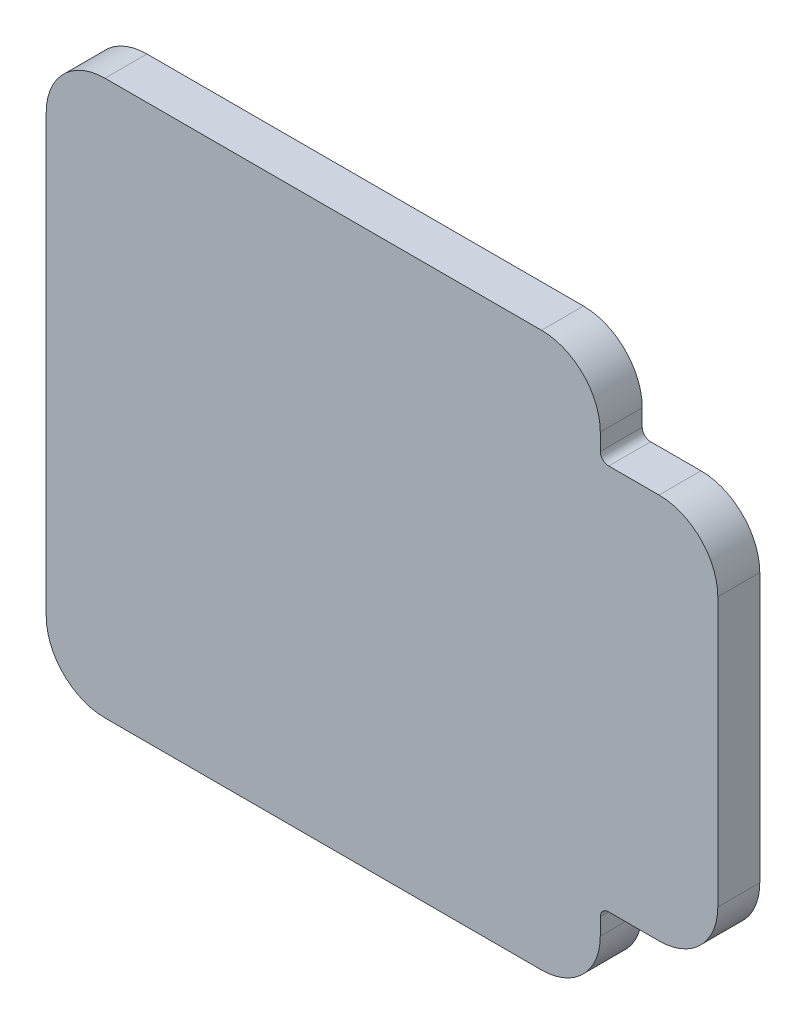
ISO-10303-21;
HEADER;
FILE_DESCRIPTION(('STEP AP214'),'2;1');
FILE_NAME('part.step','',(''),(''),'','','');
FILE_SCHEMA(('AUTOMOTIVE_DESIGN { 1 0 10303 214 1 1 1 1 }'));
ENDSEC;
DATA;
#1=APPLICATION_CONTEXT('core data for automotive mechanical design processes');
#2=APPLICATION_PROTOCOL_DEFINITION('international standard','automotive_design',2000,#1);
#3=PRODUCT_CONTEXT('',#1,'mechanical');
#4=PRODUCT('Part','Part','',(#3));
#5=PRODUCT_RELATED_PRODUCT_CATEGORY('part','',(#4));
#6=PRODUCT_DEFINITION_FORMATION('','',#4);
#7=PRODUCT_DEFINITION_CONTEXT('part definition',#1,'design');
#8=PRODUCT_DEFINITION('design','',#6,#7);
#9=PRODUCT_DEFINITION_SHAPE('','',#8);
#10=(LENGTH_UNIT() NAMED_UNIT(*) SI_UNIT(.MILLI.,.METRE.));
#11=(NAMED_UNIT(*) PLANE_ANGLE_UNIT() SI_UNIT($,.RADIAN.));
#12=(NAMED_UNIT(*) SI_UNIT($,.STERADIAN.) SOLID_ANGLE_UNIT());
#13=UNCERTAINTY_MEASURE_WITH_UNIT(LENGTH_MEASURE(1.E-05),#10,'distance_accuracy_value','');
#14=(GEOMETRIC_REPRESENTATION_CONTEXT(3) GLOBAL_UNCERTAINTY_ASSIGNED_CONTEXT((#13)) GLOBAL_UNIT_ASSIGNED_CONTEXT((#10,
#11,#12)) REPRESENTATION_CONTEXT('',''));
#15=CARTESIAN_POINT('',(0.,0.,0.));
#16=DIRECTION('',(0.,0.,1.));
#17=DIRECTION('',(1.,0.,0.));
#18=AXIS2_PLACEMENT_3D('',#15,#16,#17);
#19=CARTESIAN_POINT('',(-6.7960756515444,-23.1450892857143,2.5));
#20=DIRECTION('',(0.,0.,-1.));
#21=DIRECTION('',(-1.,0.,0.));
#22=AXIS2_PLACEMENT_3D('',#19,#20,#21);
#23=CYLINDRICAL_SURFACE('',#22,3.5);
#24=CARTESIAN_POINT('',(-6.7960756515444,-23.1450892857143,0.));
#25=DIRECTION('',(0.,0.,-1.));
#26=DIRECTION('',(-1.,0.,0.));
#27=AXIS2_PLACEMENT_3D('',#24,#25,#26);
#28=CIRCLE('',#27,3.5);
#29=CARTESIAN_POINT('',(-6.79607565154438,-26.6450892857143,0.));
#30=VERTEX_POINT('',#29);
#31=CARTESIAN_POINT('',(-10.2960756515444,-23.1450892857143,0.));
#32=VERTEX_POINT('',#31);
#33=EDGE_CURVE('E178',#30,#32,#28,.T.);
#34=ORIENTED_EDGE('',*,*,#33,.F.);
#35=DIRECTION('',(0.,0.,-1.));
#36=VECTOR('',#35,1.);
#37=CARTESIAN_POINT('',(-6.79607565154438,-26.6450892857143,2.5));
#38=LINE('',#37,#36);
#39=CARTESIAN_POINT('',(-6.79607565154438,-26.6450892857143,2.5));
#40=VERTEX_POINT('',#39);
#41=EDGE_CURVE('E11',#40,#30,#38,.T.);
#42=ORIENTED_EDGE('',*,*,#41,.F.);
#43=CARTESIAN_POINT('',(-6.7960756515444,-23.1450892857143,2.5));
#44=DIRECTION('',(0.,0.,-1.));
#45=DIRECTION('',(-1.,0.,0.));
#46=AXIS2_PLACEMENT_3D('',#43,#44,#45);
#47=CIRCLE('',#46,3.5);
#48=CARTESIAN_POINT('',(-10.2960756515444,-23.1450892857143,2.5));
#49=VERTEX_POINT('',#48);
#50=EDGE_CURVE('E222',#40,#49,#47,.T.);
#51=ORIENTED_EDGE('',*,*,#50,.T.);
#52=DIRECTION('',(0.,0.,-1.));
#53=VECTOR('',#52,1.);
#54=CARTESIAN_POINT('',(-10.2960756515444,-23.1450892857143,2.5));
#55=LINE('',#54,#53);
#56=EDGE_CURVE('E36',#49,#32,#55,.T.);
#57=ORIENTED_EDGE('',*,*,#56,.T.);
#58=EDGE_LOOP('',(#34,#42,#51,#57));
#59=FACE_BOUND('',#58,.T.);
#60=ADVANCED_FACE('F33',(#59),#23,.T.);
#61=CARTESIAN_POINT('',(19.2039243484556,-26.6450892857143,2.5));
#62=DIRECTION('',(0.,-1.,0.));
#63=DIRECTION('',(0.,0.,-1.));
#64=AXIS2_PLACEMENT_3D('',#61,#62,#63);
#65=PLANE('',#64);
#66=DIRECTION('',(-1.,0.,0.));
#67=VECTOR('',#66,1.);
#68=CARTESIAN_POINT('',(19.2039243484556,-26.6450892857143,0.));
#69=LINE('',#68,#67);
#70=CARTESIAN_POINT('',(19.2039243484556,-26.6450892857143,0.));
#71=VERTEX_POINT('',#70);
#72=EDGE_CURVE('E220',#71,#30,#69,.T.);
#73=ORIENTED_EDGE('',*,*,#72,.F.);
#74=DIRECTION('',(0.,0.,-1.));
#75=VECTOR('',#74,1.);
#76=CARTESIAN_POINT('',(19.2039243484556,-26.6450892857143,2.5));
#77=LINE('',#76,#75);
#78=CARTESIAN_POINT('',(19.2039243484556,-26.6450892857143,2.5));
#79=VERTEX_POINT('',#78);
#80=EDGE_CURVE('E42',#79,#71,#77,.T.);
#81=ORIENTED_EDGE('',*,*,#80,.F.);
#82=DIRECTION('',(-1.,0.,0.));
#83=VECTOR('',#82,1.);
#84=CARTESIAN_POINT('',(19.2039243484556,-26.6450892857143,2.5));
#85=LINE('',#84,#83);
#86=EDGE_CURVE('E168',#79,#40,#85,.T.);
#87=ORIENTED_EDGE('',*,*,#86,.T.);
#88=ORIENTED_EDGE('',*,*,#41,.T.);
#89=EDGE_LOOP('',(#73,#81,#87,#88));
#90=FACE_BOUND('',#89,.T.);
#91=ADVANCED_FACE('F251',(#90),#65,.T.);
#92=CARTESIAN_POINT('',(19.2039243484556,-23.1450892857143,2.5));
#93=DIRECTION('',(0.,0.,-1.));
#94=DIRECTION('',(-1.,0.,0.));
#95=AXIS2_PLACEMENT_3D('',#92,#93,#94);
#96=CYLINDRICAL_SURFACE('',#95,3.5);
#97=CARTESIAN_POINT('',(19.2039243484556,-23.1450892857143,0.));
#98=DIRECTION('',(0.,0.,-1.));
#99=DIRECTION('',(-1.,0.,0.));
#100=AXIS2_PLACEMENT_3D('',#97,#98,#99);
#101=CIRCLE('',#100,3.5);
#102=CARTESIAN_POINT('',(22.7039243484556,-23.1450892857143,0.));
#103=VERTEX_POINT('',#102);
#104=EDGE_CURVE('E155',#103,#71,#101,.T.);
#105=ORIENTED_EDGE('',*,*,#104,.F.);
#106=DIRECTION('',(0.,0.,-1.));
#107=VECTOR('',#106,1.);
#108=CARTESIAN_POINT('',(22.7039243484556,-23.1450892857143,2.5));
#109=LINE('',#108,#107);
#110=CARTESIAN_POINT('',(22.7039243484556,-23.1450892857143,2.5));
#111=VERTEX_POINT('',#110);
#112=EDGE_CURVE('E150',#111,#103,#109,.T.);
#113=ORIENTED_EDGE('',*,*,#112,.F.);
#114=CARTESIAN_POINT('',(19.2039243484556,-23.1450892857143,2.5));
#115=DIRECTION('',(0.,0.,-1.));
#116=DIRECTION('',(-1.,0.,0.));
#117=AXIS2_PLACEMENT_3D('',#114,#115,#116);
#118=CIRCLE('',#117,3.5);
#119=EDGE_CURVE('E153',#111,#79,#118,.T.);
#120=ORIENTED_EDGE('',*,*,#119,.T.);
#121=ORIENTED_EDGE('',*,*,#80,.T.);
#122=EDGE_LOOP('',(#105,#113,#120,#121));
#123=FACE_BOUND('',#122,.T.);
#124=ADVANCED_FACE('F152',(#123),#96,.T.);
#125=CARTESIAN_POINT('',(22.7039243484556,-22.1450892857143,2.5));
#126=DIRECTION('',(1.,0.,0.));
#127=DIRECTION('',(0.,0.,-1.));
#128=AXIS2_PLACEMENT_3D('',#125,#126,#127);
#129=PLANE('',#128);
#130=DIRECTION('',(0.,-1.,0.));
#131=VECTOR('',#130,1.);
#132=CARTESIAN_POINT('',(22.7039243484556,-22.1450892857143,0.));
#133=LINE('',#132,#131);
#134=CARTESIAN_POINT('',(22.7039243484556,-22.1450892857143,0.));
#135=VERTEX_POINT('',#134);
#136=EDGE_CURVE('E217',#135,#103,#133,.T.);
#137=ORIENTED_EDGE('',*,*,#136,.F.);
#138=DIRECTION('',(0.,0.,-1.));
#139=VECTOR('',#138,1.);
#140=CARTESIAN_POINT('',(22.7039243484556,-22.1450892857143,2.5));
#141=LINE('',#140,#139);
#142=CARTESIAN_POINT('',(22.7039243484556,-22.1450892857143,2.5));
#143=VERTEX_POINT('',#142);
#144=EDGE_CURVE('E160',#143,#135,#141,.T.);
#145=ORIENTED_EDGE('',*,*,#144,.F.);
#146=DIRECTION('',(0.,-1.,0.));
#147=VECTOR('',#146,1.);
#148=CARTESIAN_POINT('',(22.7039243484556,-22.1450892857143,2.5));
#149=LINE('',#148,#147);
#150=EDGE_CURVE('E166',#143,#111,#149,.T.);
#151=ORIENTED_EDGE('',*,*,#150,.T.);
#152=ORIENTED_EDGE('',*,*,#112,.T.);
#153=EDGE_LOOP('',(#137,#145,#151,#152));
#154=FACE_BOUND('',#153,.T.);
#155=ADVANCED_FACE('F170',(#154),#129,.T.);
#156=CARTESIAN_POINT('',(23.2039243484556,-22.1450892857143,2.5));
#157=DIRECTION('',(0.,0.,-1.));
#158=DIRECTION('',(-1.,0.,0.));
#159=AXIS2_PLACEMENT_3D('',#156,#157,#158);
#160=CYLINDRICAL_SURFACE('',#159,0.499999999999997);
#161=CARTESIAN_POINT('',(23.2039243484556,-22.1450892857143,0.));
#162=DIRECTION('',(0.,0.,1.));
#163=DIRECTION('',(1.,0.,0.));
#164=AXIS2_PLACEMENT_3D('',#161,#162,#163);
#165=CIRCLE('',#164,0.499999999999997);
#166=CARTESIAN_POINT('',(23.2039243484556,-21.6450892857143,0.));
#167=VERTEX_POINT('',#166);
#168=EDGE_CURVE('E214',#167,#135,#165,.T.);
#169=ORIENTED_EDGE('',*,*,#168,.F.);
#170=DIRECTION('',(0.,0.,-1.));
#171=VECTOR('',#170,1.);
#172=CARTESIAN_POINT('',(23.2039243484556,-21.6450892857143,2.5));
#173=LINE('',#172,#171);
#174=CARTESIAN_POINT('',(23.2039243484556,-21.6450892857143,2.5));
#175=VERTEX_POINT('',#174);
#176=EDGE_CURVE('E226',#175,#167,#173,.T.);
#177=ORIENTED_EDGE('',*,*,#176,.F.);
#178=CARTESIAN_POINT('',(23.2039243484556,-22.1450892857143,2.5));
#179=DIRECTION('',(0.,0.,1.));
#180=DIRECTION('',(1.,0.,0.));
#181=AXIS2_PLACEMENT_3D('',#178,#179,#180);
#182=CIRCLE('',#181,0.499999999999997);
#183=EDGE_CURVE('E171',#175,#143,#182,.T.);
#184=ORIENTED_EDGE('',*,*,#183,.T.);
#185=ORIENTED_EDGE('',*,*,#144,.T.);
#186=EDGE_LOOP('',(#169,#177,#184,#185));
#187=FACE_BOUND('',#186,.T.);
#188=ADVANCED_FACE('F264',(#187),#160,.F.);
#189=CARTESIAN_POINT('',(26.2039243484556,-21.6450892857143,2.5));
#190=DIRECTION('',(0.,-1.,0.));
#191=DIRECTION('',(0.,0.,-1.));
#192=AXIS2_PLACEMENT_3D('',#189,#190,#191);
#193=PLANE('',#192);
#194=DIRECTION('',(-1.,0.,0.));
#195=VECTOR('',#194,1.);
#196=CARTESIAN_POINT('',(26.2039243484556,-21.6450892857143,0.));
#197=LINE('',#196,#195);
#198=CARTESIAN_POINT('',(26.2039243484556,-21.6450892857143,0.));
#199=VERTEX_POINT('',#198);
#200=EDGE_CURVE('E211',#199,#167,#197,.T.);
#201=ORIENTED_EDGE('',*,*,#200,.F.);
#202=DIRECTION('',(0.,0.,-1.));
#203=VECTOR('',#202,1.);
#204=CARTESIAN_POINT('',(26.2039243484556,-21.6450892857143,2.5));
#205=LINE('',#204,#203);
#206=CARTESIAN_POINT('',(26.2039243484556,-21.6450892857143,2.5));
#207=VERTEX_POINT('',#206);
#208=EDGE_CURVE('E228',#207,#199,#205,.T.);
#209=ORIENTED_EDGE('',*,*,#208,.F.);
#210=DIRECTION('',(-1.,0.,0.));
#211=VECTOR('',#210,1.);
#212=CARTESIAN_POINT('',(26.2039243484556,-21.6450892857143,2.5));
#213=LINE('',#212,#211);
#214=EDGE_CURVE('E173',#207,#175,#213,.T.);
#215=ORIENTED_EDGE('',*,*,#214,.T.);
#216=ORIENTED_EDGE('',*,*,#176,.T.);
#217=EDGE_LOOP('',(#201,#209,#215,#216));
#218=FACE_BOUND('',#217,.T.);
#219=ADVANCED_FACE('F267',(#218),#193,.T.);
#220=CARTESIAN_POINT('',(26.2039243484556,-18.1450892857143,2.5));
#221=DIRECTION('',(0.,0.,-1.));
#222=DIRECTION('',(-1.,0.,0.));
#223=AXIS2_PLACEMENT_3D('',#220,#221,#222);
#224=CYLINDRICAL_SURFACE('',#223,3.5);
#225=CARTESIAN_POINT('',(26.2039243484556,-18.1450892857143,0.));
#226=DIRECTION('',(0.,0.,-1.));
#227=DIRECTION('',(-1.,0.,0.));
#228=AXIS2_PLACEMENT_3D('',#225,#226,#227);
#229=CIRCLE('',#228,3.5);
#230=CARTESIAN_POINT('',(29.7039243484556,-18.1450892857143,0.));
#231=VERTEX_POINT('',#230);
#232=EDGE_CURVE('E208',#231,#199,#229,.T.);
#233=ORIENTED_EDGE('',*,*,#232,.F.);
#234=DIRECTION('',(0.,0.,-1.));
#235=VECTOR('',#234,1.);
#236=CARTESIAN_POINT('',(29.7039243484556,-18.1450892857143,2.5));
#237=LINE('',#236,#235);
#238=CARTESIAN_POINT('',(29.7039243484556,-18.1450892857143,2.5));
#239=VERTEX_POINT('',#238);
#240=EDGE_CURVE('E230',#239,#231,#237,.T.);
#241=ORIENTED_EDGE('',*,*,#240,.F.);
#242=CARTESIAN_POINT('',(26.2039243484556,-18.1450892857143,2.5));
#243=DIRECTION('',(0.,0.,-1.));
#244=DIRECTION('',(-1.,0.,0.));
#245=AXIS2_PLACEMENT_3D('',#242,#243,#244);
#246=CIRCLE('',#245,3.5);
#247=EDGE_CURVE('E450',#239,#207,#246,.T.);
#248=ORIENTED_EDGE('',*,*,#247,.T.);
#249=ORIENTED_EDGE('',*,*,#208,.T.);
#250=EDGE_LOOP('',(#233,#241,#248,#249));
#251=FACE_BOUND('',#250,.T.);
#252=ADVANCED_FACE('F271',(#251),#224,.T.);
#253=CARTESIAN_POINT('',(29.7039243484556,-2.14508928571428,2.5));
#254=DIRECTION('',(1.,0.,0.));
#255=DIRECTION('',(0.,1.,0.));
#256=AXIS2_PLACEMENT_3D('',#253,#254,#255);
#257=PLANE('',#256);
#258=DIRECTION('',(0.,-1.,0.));
#259=VECTOR('',#258,1.);
#260=CARTESIAN_POINT('',(29.7039243484556,-2.14508928571428,0.));
#261=LINE('',#260,#259);
#262=CARTESIAN_POINT('',(29.7039243484556,-2.14508928571428,0.));
#263=VERTEX_POINT('',#262);
#264=EDGE_CURVE('E205',#263,#231,#261,.T.);
#265=ORIENTED_EDGE('',*,*,#264,.F.);
#266=DIRECTION('',(0.,0.,-1.));
#267=VECTOR('',#266,1.);
#268=CARTESIAN_POINT('',(29.7039243484556,-2.14508928571428,2.5));
#269=LINE('',#268,#267);
#270=CARTESIAN_POINT('',(29.7039243484556,-2.14508928571428,2.5));
#271=VERTEX_POINT('',#270);
#272=EDGE_CURVE('E232',#271,#263,#269,.T.);
#273=ORIENTED_EDGE('',*,*,#272,.F.);
#274=DIRECTION('',(0.,-1.,0.));
#275=VECTOR('',#274,1.);
#276=CARTESIAN_POINT('',(29.7039243484556,-2.14508928571428,2.5));
#277=LINE('',#276,#275);
#278=EDGE_CURVE('E443',#271,#239,#277,.T.);
#279=ORIENTED_EDGE('',*,*,#278,.T.);
#280=ORIENTED_EDGE('',*,*,#240,.T.);
#281=EDGE_LOOP('',(#265,#273,#279,#280));
#282=FACE_BOUND('',#281,.T.);
#283=ADVANCED_FACE('F275',(#282),#257,.T.);
#284=CARTESIAN_POINT('',(26.2039243484556,-2.14508928571428,2.5));
#285=DIRECTION('',(0.,0.,-1.));
#286=DIRECTION('',(-1.,0.,0.));
#287=AXIS2_PLACEMENT_3D('',#284,#285,#286);
#288=CYLINDRICAL_SURFACE('',#287,3.5);
#289=CARTESIAN_POINT('',(26.2039243484556,-2.14508928571428,0.));
#290=DIRECTION('',(0.,0.,-1.));
#291=DIRECTION('',(-1.,0.,0.));
#292=AXIS2_PLACEMENT_3D('',#289,#290,#291);
#293=CIRCLE('',#292,3.5);
#294=CARTESIAN_POINT('',(26.2039243484556,1.35491071428572,0.));
#295=VERTEX_POINT('',#294);
#296=EDGE_CURVE('E202',#295,#263,#293,.T.);
#297=ORIENTED_EDGE('',*,*,#296,.F.);
#298=DIRECTION('',(0.,0.,-1.));
#299=VECTOR('',#298,1.);
#300=CARTESIAN_POINT('',(26.2039243484556,1.35491071428572,2.5));
#301=LINE('',#300,#299);
#302=CARTESIAN_POINT('',(26.2039243484556,1.35491071428572,2.5));
#303=VERTEX_POINT('',#302);
#304=EDGE_CURVE('E234',#303,#295,#301,.T.);
#305=ORIENTED_EDGE('',*,*,#304,.F.);
#306=CARTESIAN_POINT('',(26.2039243484556,-2.14508928571428,2.5));
#307=DIRECTION('',(0.,0.,-1.));
#308=DIRECTION('',(-1.,0.,0.));
#309=AXIS2_PLACEMENT_3D('',#306,#307,#308);
#310=CIRCLE('',#309,3.5);
#311=EDGE_CURVE('E439',#303,#271,#310,.T.);
#312=ORIENTED_EDGE('',*,*,#311,.T.);
#313=ORIENTED_EDGE('',*,*,#272,.T.);
#314=EDGE_LOOP('',(#297,#305,#312,#313));
#315=FACE_BOUND('',#314,.T.);
#316=ADVANCED_FACE('F279',(#315),#288,.T.);
#317=CARTESIAN_POINT('',(23.2039243484556,1.35491071428572,2.5));
#318=DIRECTION('',(0.,1.,0.));
#319=DIRECTION('',(-1.,0.,0.));
#320=AXIS2_PLACEMENT_3D('',#317,#318,#319);
#321=PLANE('',#320);
#322=DIRECTION('',(1.,0.,0.));
#323=VECTOR('',#322,1.);
#324=CARTESIAN_POINT('',(23.2039243484556,1.35491071428572,0.));
#325=LINE('',#324,#323);
#326=CARTESIAN_POINT('',(23.2039243484556,1.35491071428572,0.));
#327=VERTEX_POINT('',#326);
#328=EDGE_CURVE('E199',#327,#295,#325,.T.);
#329=ORIENTED_EDGE('',*,*,#328,.F.);
#330=DIRECTION('',(0.,0.,-1.));
#331=VECTOR('',#330,1.);
#332=CARTESIAN_POINT('',(23.2039243484556,1.35491071428572,2.5));
#333=LINE('',#332,#331);
#334=CARTESIAN_POINT('',(23.2039243484556,1.35491071428572,2.5));
#335=VERTEX_POINT('',#334);
#336=EDGE_CURVE('E236',#335,#327,#333,.T.);
#337=ORIENTED_EDGE('',*,*,#336,.F.);
#338=DIRECTION('',(1.,0.,0.));
#339=VECTOR('',#338,1.);
#340=CARTESIAN_POINT('',(23.2039243484556,1.35491071428572,2.5));
#341=LINE('',#340,#339);
#342=EDGE_CURVE('E455',#335,#303,#341,.T.);
#343=ORIENTED_EDGE('',*,*,#342,.T.);
#344=ORIENTED_EDGE('',*,*,#304,.T.);
#345=EDGE_LOOP('',(#329,#337,#343,#344));
#346=FACE_BOUND('',#345,.T.);
#347=ADVANCED_FACE('F283',(#346),#321,.T.);
#348=CARTESIAN_POINT('',(23.2039243484556,1.85491071428572,2.5));
#349=DIRECTION('',(0.,0.,-1.));
#350=DIRECTION('',(-1.,0.,0.));
#351=AXIS2_PLACEMENT_3D('',#348,#349,#350);
#352=CYLINDRICAL_SURFACE('',#351,0.5);
#353=CARTESIAN_POINT('',(23.2039243484556,1.85491071428572,0.));
#354=DIRECTION('',(0.,0.,1.));
#355=DIRECTION('',(1.,0.,0.));
#356=AXIS2_PLACEMENT_3D('',#353,#354,#355);
#357=CIRCLE('',#356,0.5);
#358=CARTESIAN_POINT('',(22.7039243484556,1.85491071428572,0.));
#359=VERTEX_POINT('',#358);
#360=EDGE_CURVE('E196',#359,#327,#357,.T.);
#361=ORIENTED_EDGE('',*,*,#360,.F.);
#362=DIRECTION('',(0.,0.,-1.));
#363=VECTOR('',#362,1.);
#364=CARTESIAN_POINT('',(22.7039243484556,1.85491071428572,2.5));
#365=LINE('',#364,#363);
#366=CARTESIAN_POINT('',(22.7039243484556,1.85491071428572,2.5));
#367=VERTEX_POINT('',#366);
#368=EDGE_CURVE('E238',#367,#359,#365,.T.);
#369=ORIENTED_EDGE('',*,*,#368,.F.);
#370=CARTESIAN_POINT('',(23.2039243484556,1.85491071428572,2.5));
#371=DIRECTION('',(0.,0.,1.));
#372=DIRECTION('',(1.,0.,0.));
#373=AXIS2_PLACEMENT_3D('',#370,#371,#372);
#374=CIRCLE('',#373,0.5);
#375=EDGE_CURVE('E432',#367,#335,#374,.T.);
#376=ORIENTED_EDGE('',*,*,#375,.T.);
#377=ORIENTED_EDGE('',*,*,#336,.T.);
#378=EDGE_LOOP('',(#361,#369,#376,#377));
#379=FACE_BOUND('',#378,.T.);
#380=ADVANCED_FACE('F287',(#379),#352,.F.);
#381=CARTESIAN_POINT('',(22.7039243484556,2.8549107142857,2.5));
#382=DIRECTION('',(1.,0.,0.));
#383=DIRECTION('',(0.,1.,0.));
#384=AXIS2_PLACEMENT_3D('',#381,#382,#383);
#385=PLANE('',#384);
#386=DIRECTION('',(0.,-1.,0.));
#387=VECTOR('',#386,1.);
#388=CARTESIAN_POINT('',(22.7039243484556,2.8549107142857,0.));
#389=LINE('',#388,#387);
#390=CARTESIAN_POINT('',(22.7039243484556,2.8549107142857,0.));
#391=VERTEX_POINT('',#390);
#392=EDGE_CURVE('E193',#391,#359,#389,.T.);
#393=ORIENTED_EDGE('',*,*,#392,.F.);
#394=DIRECTION('',(0.,0.,-1.));
#395=VECTOR('',#394,1.);
#396=CARTESIAN_POINT('',(22.7039243484556,2.8549107142857,2.5));
#397=LINE('',#396,#395);
#398=CARTESIAN_POINT('',(22.7039243484556,2.8549107142857,2.5));
#399=VERTEX_POINT('',#398);
#400=EDGE_CURVE('E240',#399,#391,#397,.T.);
#401=ORIENTED_EDGE('',*,*,#400,.F.);
#402=DIRECTION('',(0.,-1.,0.));
#403=VECTOR('',#402,1.);
#404=CARTESIAN_POINT('',(22.7039243484556,2.8549107142857,2.5));
#405=LINE('',#404,#403);
#406=EDGE_CURVE('E428',#399,#367,#405,.T.);
#407=ORIENTED_EDGE('',*,*,#406,.T.);
#408=ORIENTED_EDGE('',*,*,#368,.T.);
#409=EDGE_LOOP('',(#393,#401,#407,#408));
#410=FACE_BOUND('',#409,.T.);
#411=ADVANCED_FACE('F291',(#410),#385,.T.);
#412=CARTESIAN_POINT('',(19.2039243484556,2.85491071428571,2.5));
#413=DIRECTION('',(0.,0.,-1.));
#414=DIRECTION('',(-1.,0.,0.));
#415=AXIS2_PLACEMENT_3D('',#412,#413,#414);
#416=CYLINDRICAL_SURFACE('',#415,3.5);
#417=CARTESIAN_POINT('',(19.2039243484556,2.85491071428571,0.));
#418=DIRECTION('',(0.,0.,-1.));
#419=DIRECTION('',(-1.,0.,0.));
#420=AXIS2_PLACEMENT_3D('',#417,#418,#419);
#421=CIRCLE('',#420,3.5);
#422=CARTESIAN_POINT('',(19.2039243484556,6.35491071428571,0.));
#423=VERTEX_POINT('',#422);
#424=EDGE_CURVE('E190',#423,#391,#421,.T.);
#425=ORIENTED_EDGE('',*,*,#424,.F.);
#426=DIRECTION('',(0.,0.,-1.));
#427=VECTOR('',#426,1.);
#428=CARTESIAN_POINT('',(19.2039243484556,6.35491071428571,2.5));
#429=LINE('',#428,#427);
#430=CARTESIAN_POINT('',(19.2039243484556,6.35491071428571,2.5));
#431=VERTEX_POINT('',#430);
#432=EDGE_CURVE('E242',#431,#423,#429,.T.);
#433=ORIENTED_EDGE('',*,*,#432,.F.);
#434=CARTESIAN_POINT('',(19.2039243484556,2.85491071428571,2.5));
#435=DIRECTION('',(0.,0.,-1.));
#436=DIRECTION('',(-1.,0.,0.));
#437=AXIS2_PLACEMENT_3D('',#434,#435,#436);
#438=CIRCLE('',#437,3.5);
#439=EDGE_CURVE('E459',#431,#399,#438,.T.);
#440=ORIENTED_EDGE('',*,*,#439,.T.);
#441=ORIENTED_EDGE('',*,*,#400,.T.);
#442=EDGE_LOOP('',(#425,#433,#440,#441));
#443=FACE_BOUND('',#442,.T.);
#444=ADVANCED_FACE('F295',(#443),#416,.T.);
#445=CARTESIAN_POINT('',(-6.79607565154438,6.35491071428571,2.5));
#446=DIRECTION('',(0.,1.,0.));
#447=DIRECTION('',(-1.,0.,0.));
#448=AXIS2_PLACEMENT_3D('',#445,#446,#447);
#449=PLANE('',#448);
#450=DIRECTION('',(1.,0.,0.));
#451=VECTOR('',#450,1.);
#452=CARTESIAN_POINT('',(-6.79607565154438,6.35491071428571,0.));
#453=LINE('',#452,#451);
#454=CARTESIAN_POINT('',(-6.79607565154438,6.35491071428571,0.));
#455=VERTEX_POINT('',#454);
#456=EDGE_CURVE('E187',#455,#423,#453,.T.);
#457=ORIENTED_EDGE('',*,*,#456,.F.);
#458=DIRECTION('',(0.,0.,-1.));
#459=VECTOR('',#458,1.);
#460=CARTESIAN_POINT('',(-6.79607565154438,6.35491071428571,2.5));
#461=LINE('',#460,#459);
#462=CARTESIAN_POINT('',(-6.79607565154438,6.35491071428571,2.5));
#463=VERTEX_POINT('',#462);
#464=EDGE_CURVE('E244',#463,#455,#461,.T.);
#465=ORIENTED_EDGE('',*,*,#464,.F.);
#466=DIRECTION('',(1.,0.,0.));
#467=VECTOR('',#466,1.);
#468=CARTESIAN_POINT('',(-6.79607565154438,6.35491071428571,2.5));
#469=LINE('',#468,#467);
#470=EDGE_CURVE('E421',#463,#431,#469,.T.);
#471=ORIENTED_EDGE('',*,*,#470,.T.);
#472=ORIENTED_EDGE('',*,*,#432,.T.);
#473=EDGE_LOOP('',(#457,#465,#471,#472));
#474=FACE_BOUND('',#473,.T.);
#475=ADVANCED_FACE('F299',(#474),#449,.T.);
#476=CARTESIAN_POINT('',(-6.7960756515444,2.85491071428571,2.5));
#477=DIRECTION('',(0.,0.,-1.));
#478=DIRECTION('',(-1.,0.,0.));
#479=AXIS2_PLACEMENT_3D('',#476,#477,#478);
#480=CYLINDRICAL_SURFACE('',#479,3.5);
#481=CARTESIAN_POINT('',(-6.7960756515444,2.85491071428571,0.));
#482=DIRECTION('',(0.,0.,1.));
#483=DIRECTION('',(1.,0.,0.));
#484=AXIS2_PLACEMENT_3D('',#481,#482,#483);
#485=CIRCLE('',#484,3.5);
#486=CARTESIAN_POINT('',(-10.2960756515444,2.85491071428569,0.));
#487=VERTEX_POINT('',#486);
#488=EDGE_CURVE('E184',#455,#487,#485,.T.);
#489=ORIENTED_EDGE('',*,*,#488,.T.);
#490=DIRECTION('',(0.,0.,-1.));
#491=VECTOR('',#490,1.);
#492=CARTESIAN_POINT('',(-10.2960756515444,2.85491071428569,2.5));
#493=LINE('',#492,#491);
#494=CARTESIAN_POINT('',(-10.2960756515444,2.85491071428569,2.5));
#495=VERTEX_POINT('',#494);
#496=EDGE_CURVE('E245',#495,#487,#493,.T.);
#497=ORIENTED_EDGE('',*,*,#496,.F.);
#498=CARTESIAN_POINT('',(-6.7960756515444,2.85491071428571,2.5));
#499=DIRECTION('',(0.,0.,1.));
#500=DIRECTION('',(1.,0.,0.));
#501=AXIS2_PLACEMENT_3D('',#498,#499,#500);
#502=CIRCLE('',#501,3.5);
#503=EDGE_CURVE('E462',#463,#495,#502,.T.);
#504=ORIENTED_EDGE('',*,*,#503,.F.);
#505=ORIENTED_EDGE('',*,*,#464,.T.);
#506=EDGE_LOOP('',(#489,#497,#504,#505));
#507=FACE_BOUND('',#506,.T.);
#508=ADVANCED_FACE('F303',(#507),#480,.T.);
#509=CARTESIAN_POINT('',(-10.2960756515444,-23.1450892857143,2.5));
#510=DIRECTION('',(-1.,0.,0.));
#511=DIRECTION('',(0.,0.,1.));
#512=AXIS2_PLACEMENT_3D('',#509,#510,#511);
#513=PLANE('',#512);
#514=DIRECTION('',(0.,1.,0.));
#515=VECTOR('',#514,1.);
#516=CARTESIAN_POINT('',(-10.2960756515444,-23.1450892857143,0.));
#517=LINE('',#516,#515);
#518=EDGE_CURVE('E181',#32,#487,#517,.T.);
#519=ORIENTED_EDGE('',*,*,#518,.F.);
#520=ORIENTED_EDGE('',*,*,#56,.F.);
#521=DIRECTION('',(0.,1.,0.));
#522=VECTOR('',#521,1.);
#523=CARTESIAN_POINT('',(-10.2960756515444,-23.1450892857143,2.5));
#524=LINE('',#523,#522);
#525=EDGE_CURVE('E464',#49,#495,#524,.T.);
#526=ORIENTED_EDGE('',*,*,#525,.T.);
#527=ORIENTED_EDGE('',*,*,#496,.T.);
#528=EDGE_LOOP('',(#519,#520,#526,#527));
#529=FACE_BOUND('',#528,.T.);
#530=ADVANCED_FACE('F247',(#529),#513,.T.);
#531=CARTESIAN_POINT('',(-6.7960756515444,-23.1450892857143,2.5));
#532=DIRECTION('',(0.,0.,-1.));
#533=DIRECTION('',(-1.,0.,0.));
#534=AXIS2_PLACEMENT_3D('',#531,#532,#533);
#535=PLANE('',#534);
#536=ORIENTED_EDGE('',*,*,#50,.F.);
#537=ORIENTED_EDGE('',*,*,#86,.F.);
#538=ORIENTED_EDGE('',*,*,#119,.F.);
#539=ORIENTED_EDGE('',*,*,#150,.F.);
#540=ORIENTED_EDGE('',*,*,#183,.F.);
#541=ORIENTED_EDGE('',*,*,#214,.F.);
#542=ORIENTED_EDGE('',*,*,#247,.F.);
#543=ORIENTED_EDGE('',*,*,#278,.F.);
#544=ORIENTED_EDGE('',*,*,#311,.F.);
#545=ORIENTED_EDGE('',*,*,#342,.F.);
#546=ORIENTED_EDGE('',*,*,#375,.F.);
#547=ORIENTED_EDGE('',*,*,#406,.F.);
#548=ORIENTED_EDGE('',*,*,#439,.F.);
#549=ORIENTED_EDGE('',*,*,#470,.F.);
#550=ORIENTED_EDGE('',*,*,#503,.T.);
#551=ORIENTED_EDGE('',*,*,#525,.F.);
#552=EDGE_LOOP('',(#536,#537,#538,#539,#540,#541,#542,#543,#544,#545,#546,#547,#548,#549,#550,#551));
#553=FACE_BOUND('',#552,.T.);
#554=ADVANCED_FACE('F164',(#553),#535,.F.);
#555=CARTESIAN_POINT('',(-6.7960756515444,-23.1450892857143,0.));
#556=DIRECTION('',(0.,0.,-1.));
#557=DIRECTION('',(-1.,0.,0.));
#558=AXIS2_PLACEMENT_3D('',#555,#556,#557);
#559=PLANE('',#558);
#560=ORIENTED_EDGE('',*,*,#33,.T.);
#561=ORIENTED_EDGE('',*,*,#518,.T.);
#562=ORIENTED_EDGE('',*,*,#488,.F.);
#563=ORIENTED_EDGE('',*,*,#456,.T.);
#564=ORIENTED_EDGE('',*,*,#424,.T.);
#565=ORIENTED_EDGE('',*,*,#392,.T.);
#566=ORIENTED_EDGE('',*,*,#360,.T.);
#567=ORIENTED_EDGE('',*,*,#328,.T.);
#568=ORIENTED_EDGE('',*,*,#296,.T.);
#569=ORIENTED_EDGE('',*,*,#264,.T.);
#570=ORIENTED_EDGE('',*,*,#232,.T.);
#571=ORIENTED_EDGE('',*,*,#200,.T.);
#572=ORIENTED_EDGE('',*,*,#168,.T.);
#573=ORIENTED_EDGE('',*,*,#136,.T.);
#574=ORIENTED_EDGE('',*,*,#104,.T.);
#575=ORIENTED_EDGE('',*,*,#72,.T.);
#576=EDGE_LOOP('',(#560,#561,#562,#563,#564,#565,#566,#567,#568,#569,#570,#571,#572,#573,#574,#575));
#577=FACE_BOUND('',#576,.T.);
#578=ADVANCED_FACE('F250',(#577),#559,.T.);
#579=CLOSED_SHELL('',(#60,#91,#124,#155,#188,#219,#252,#283,#316,#347,#380,#411,#444,#475,#508,
#530,#554,#578));
#580=MANIFOLD_SOLID_BREP('B2',#579);
#581=ADVANCED_BREP_SHAPE_REPRESENTATION('',(#18,#580),#14);
#582=SHAPE_DEFINITION_REPRESENTATION(#9,#581);
ENDSEC;
END-ISO-10303-21;
